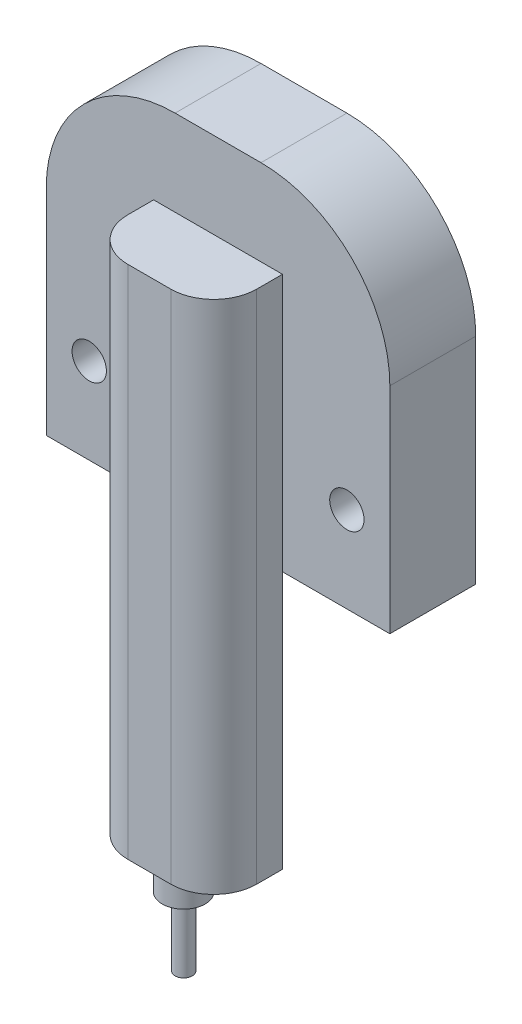
ISO-10303-21;
HEADER;
FILE_DESCRIPTION(('STEP AP214'),'2;1');
FILE_NAME('part.step','',(''),(''),'','','');
FILE_SCHEMA(('AUTOMOTIVE_DESIGN { 1 0 10303 214 1 1 1 1 }'));
ENDSEC;
DATA;
#1=APPLICATION_CONTEXT('core data for automotive mechanical design processes');
#2=APPLICATION_PROTOCOL_DEFINITION('international standard','automotive_design',2000,#1);
#3=PRODUCT_CONTEXT('',#1,'mechanical');
#4=PRODUCT('Part','Part','',(#3));
#5=PRODUCT_RELATED_PRODUCT_CATEGORY('part','',(#4));
#6=PRODUCT_DEFINITION_FORMATION('','',#4);
#7=PRODUCT_DEFINITION_CONTEXT('part definition',#1,'design');
#8=PRODUCT_DEFINITION('design','',#6,#7);
#9=PRODUCT_DEFINITION_SHAPE('','',#8);
#10=(LENGTH_UNIT() NAMED_UNIT(*) SI_UNIT(.MILLI.,.METRE.));
#11=(NAMED_UNIT(*) PLANE_ANGLE_UNIT() SI_UNIT($,.RADIAN.));
#12=(NAMED_UNIT(*) SI_UNIT($,.STERADIAN.) SOLID_ANGLE_UNIT());
#13=UNCERTAINTY_MEASURE_WITH_UNIT(LENGTH_MEASURE(1.E-05),#10,'distance_accuracy_value','');
#14=(GEOMETRIC_REPRESENTATION_CONTEXT(3) GLOBAL_UNCERTAINTY_ASSIGNED_CONTEXT((#13)) GLOBAL_UNIT_ASSIGNED_CONTEXT((#10,
#11,#12)) REPRESENTATION_CONTEXT('',''));
#15=CARTESIAN_POINT('',(0.,0.,0.));
#16=DIRECTION('',(0.,0.,1.));
#17=DIRECTION('',(1.,0.,0.));
#18=AXIS2_PLACEMENT_3D('',#15,#16,#17);
#19=CARTESIAN_POINT('',(0.,-34.,9.));
#20=DIRECTION('',(0.,-1.,0.));
#21=DIRECTION('',(0.,0.,-1.));
#22=AXIS2_PLACEMENT_3D('',#19,#20,#21);
#23=PLANE('',#22);
#24=CARTESIAN_POINT('',(0.,-34.,9.));
#25=DIRECTION('',(0.,-1.,0.));
#26=DIRECTION('',(0.,0.,-1.));
#27=AXIS2_PLACEMENT_3D('',#24,#25,#26);
#28=CIRCLE('',#27,2.5);
#29=CARTESIAN_POINT('',(0.,-34.,6.5));
#30=VERTEX_POINT('',#29);
#31=EDGE_CURVE('E152',#30,#30,#28,.T.);
#32=ORIENTED_EDGE('',*,*,#31,.T.);
#33=EDGE_LOOP('',(#32));
#34=FACE_BOUND('',#33,.T.);
#35=CARTESIAN_POINT('',(0.,-34.,9.));
#36=DIRECTION('',(0.,-1.,0.));
#37=DIRECTION('',(0.,0.,-1.));
#38=AXIS2_PLACEMENT_3D('',#35,#36,#37);
#39=CIRCLE('',#38,1.);
#40=CARTESIAN_POINT('',(0.,-34.,8.));
#41=VERTEX_POINT('',#40);
#42=EDGE_CURVE('E371',#41,#41,#39,.T.);
#43=ORIENTED_EDGE('',*,*,#42,.F.);
#44=EDGE_LOOP('',(#43));
#45=FACE_BOUND('',#44,.T.);
#46=ADVANCED_FACE('F33',(#34,#45),#23,.T.);
#47=CARTESIAN_POINT('',(-7.5,-30.,13.));
#48=DIRECTION('',(0.,1.,0.));
#49=DIRECTION('',(0.,0.,1.));
#50=AXIS2_PLACEMENT_3D('',#47,#48,#49);
#51=PLANE('',#50);
#52=DIRECTION('',(1.,0.,0.));
#53=VECTOR('',#52,1.);
#54=CARTESIAN_POINT('',(-7.5,-30.,13.));
#55=LINE('',#54,#53);
#56=CARTESIAN_POINT('',(-2.5,-30.,13.));
#57=VERTEX_POINT('',#56);
#58=CARTESIAN_POINT('',(2.5,-30.,13.));
#59=VERTEX_POINT('',#58);
#60=EDGE_CURVE('E162',#57,#59,#55,.T.);
#61=ORIENTED_EDGE('',*,*,#60,.F.);
#62=CARTESIAN_POINT('',(-2.5,-30.,8.));
#63=DIRECTION('',(0.,1.,0.));
#64=DIRECTION('',(0.,0.,1.));
#65=AXIS2_PLACEMENT_3D('',#62,#63,#64);
#66=CIRCLE('',#65,5.);
#67=CARTESIAN_POINT('',(-7.5,-30.,8.));
#68=VERTEX_POINT('',#67);
#69=EDGE_CURVE('E233',#57,#68,#66,.F.);
#70=ORIENTED_EDGE('',*,*,#69,.T.);
#71=DIRECTION('',(0.,0.,-1.));
#72=VECTOR('',#71,1.);
#73=CARTESIAN_POINT('',(-7.5,-30.,13.));
#74=LINE('',#73,#72);
#75=CARTESIAN_POINT('',(-7.5,-30.,5.));
#76=VERTEX_POINT('',#75);
#77=EDGE_CURVE('E134',#68,#76,#74,.T.);
#78=ORIENTED_EDGE('',*,*,#77,.T.);
#79=DIRECTION('',(1.,0.,0.));
#80=VECTOR('',#79,1.);
#81=CARTESIAN_POINT('',(-7.5,-30.,5.));
#82=LINE('',#81,#80);
#83=CARTESIAN_POINT('',(7.5,-30.,5.));
#84=VERTEX_POINT('',#83);
#85=EDGE_CURVE('E145',#76,#84,#82,.T.);
#86=ORIENTED_EDGE('',*,*,#85,.T.);
#87=DIRECTION('',(0.,0.,-1.));
#88=VECTOR('',#87,1.);
#89=CARTESIAN_POINT('',(7.5,-30.,13.));
#90=LINE('',#89,#88);
#91=CARTESIAN_POINT('',(7.5,-30.,8.));
#92=VERTEX_POINT('',#91);
#93=EDGE_CURVE('E160',#92,#84,#90,.T.);
#94=ORIENTED_EDGE('',*,*,#93,.F.);
#95=CARTESIAN_POINT('',(2.5,-30.,8.));
#96=DIRECTION('',(0.,1.,0.));
#97=DIRECTION('',(0.,0.,1.));
#98=AXIS2_PLACEMENT_3D('',#95,#96,#97);
#99=CIRCLE('',#98,5.);
#100=EDGE_CURVE('E231',#92,#59,#99,.F.);
#101=ORIENTED_EDGE('',*,*,#100,.T.);
#102=EDGE_LOOP('',(#61,#70,#78,#86,#94,#101));
#103=FACE_BOUND('',#102,.T.);
#104=CARTESIAN_POINT('',(0.,-30.,9.));
#105=DIRECTION('',(0.,1.,0.));
#106=DIRECTION('',(0.,0.,1.));
#107=AXIS2_PLACEMENT_3D('',#104,#105,#106);
#108=CIRCLE('',#107,2.5);
#109=CARTESIAN_POINT('',(0.,-30.,11.5));
#110=VERTEX_POINT('',#109);
#111=EDGE_CURVE('E222',#110,#110,#108,.F.);
#112=ORIENTED_EDGE('',*,*,#111,.F.);
#113=EDGE_LOOP('',(#112));
#114=FACE_BOUND('',#113,.T.);
#115=ADVANCED_FACE('F247',(#103,#114),#51,.F.);
#116=CARTESIAN_POINT('',(-20.,40.,5.));
#117=DIRECTION('',(0.,0.,-1.));
#118=DIRECTION('',(-1.,0.,0.));
#119=AXIS2_PLACEMENT_3D('',#116,#117,#118);
#120=PLANE('',#119);
#121=CARTESIAN_POINT('',(15.,10.,5.));
#122=DIRECTION('',(0.,0.,1.));
#123=DIRECTION('',(1.,0.,0.));
#124=AXIS2_PLACEMENT_3D('',#121,#122,#123);
#125=CIRCLE('',#124,2.);
#126=CARTESIAN_POINT('',(17.,10.,5.));
#127=VERTEX_POINT('',#126);
#128=EDGE_CURVE('E169',#127,#127,#125,.T.);
#129=ORIENTED_EDGE('',*,*,#128,.F.);
#130=EDGE_LOOP('',(#129));
#131=FACE_BOUND('',#130,.T.);
#132=CARTESIAN_POINT('',(-15.,10.,5.));
#133=DIRECTION('',(0.,0.,1.));
#134=DIRECTION('',(1.,0.,0.));
#135=AXIS2_PLACEMENT_3D('',#132,#133,#134);
#136=CIRCLE('',#135,2.);
#137=CARTESIAN_POINT('',(-13.,10.,5.));
#138=VERTEX_POINT('',#137);
#139=EDGE_CURVE('E165',#138,#138,#136,.T.);
#140=ORIENTED_EDGE('',*,*,#139,.F.);
#141=EDGE_LOOP('',(#140));
#142=FACE_BOUND('',#141,.T.);
#143=DIRECTION('',(0.,1.,0.));
#144=VECTOR('',#143,1.);
#145=CARTESIAN_POINT('',(7.5,-30.,5.));
#146=LINE('',#145,#144);
#147=CARTESIAN_POINT('',(7.5,0.,5.));
#148=VERTEX_POINT('',#147);
#149=CARTESIAN_POINT('',(7.5,30.,5.));
#150=VERTEX_POINT('',#149);
#151=EDGE_CURVE('E154',#148,#150,#146,.T.);
#152=ORIENTED_EDGE('',*,*,#151,.F.);
#153=DIRECTION('',(1.,0.,0.));
#154=VECTOR('',#153,1.);
#155=CARTESIAN_POINT('',(-20.,0.,5.));
#156=LINE('',#155,#154);
#157=CARTESIAN_POINT('',(20.,0.,5.));
#158=VERTEX_POINT('',#157);
#159=EDGE_CURVE('E193',#148,#158,#156,.T.);
#160=ORIENTED_EDGE('',*,*,#159,.T.);
#161=DIRECTION('',(0.,-1.,0.));
#162=VECTOR('',#161,1.);
#163=CARTESIAN_POINT('',(20.,40.,5.));
#164=LINE('',#163,#162);
#165=CARTESIAN_POINT('',(20.,25.,5.));
#166=VERTEX_POINT('',#165);
#167=EDGE_CURVE('E184',#166,#158,#164,.T.);
#168=ORIENTED_EDGE('',*,*,#167,.F.);
#169=CARTESIAN_POINT('',(5.,25.,5.));
#170=DIRECTION('',(0.,0.,-1.));
#171=DIRECTION('',(-1.,0.,0.));
#172=AXIS2_PLACEMENT_3D('',#169,#170,#171);
#173=CIRCLE('',#172,15.);
#174=CARTESIAN_POINT('',(5.,40.,5.));
#175=VERTEX_POINT('',#174);
#176=EDGE_CURVE('E210',#166,#175,#173,.F.);
#177=ORIENTED_EDGE('',*,*,#176,.T.);
#178=DIRECTION('',(1.,0.,0.));
#179=VECTOR('',#178,1.);
#180=CARTESIAN_POINT('',(-20.,40.,5.));
#181=LINE('',#180,#179);
#182=CARTESIAN_POINT('',(-5.,40.,5.));
#183=VERTEX_POINT('',#182);
#184=EDGE_CURVE('E181',#183,#175,#181,.T.);
#185=ORIENTED_EDGE('',*,*,#184,.F.);
#186=CARTESIAN_POINT('',(-5.,25.,5.));
#187=DIRECTION('',(0.,0.,-1.));
#188=DIRECTION('',(-1.,0.,0.));
#189=AXIS2_PLACEMENT_3D('',#186,#187,#188);
#190=CIRCLE('',#189,15.);
#191=CARTESIAN_POINT('',(-20.,25.,5.));
#192=VERTEX_POINT('',#191);
#193=EDGE_CURVE('E212',#183,#192,#190,.F.);
#194=ORIENTED_EDGE('',*,*,#193,.T.);
#195=DIRECTION('',(0.,-1.,0.));
#196=VECTOR('',#195,1.);
#197=CARTESIAN_POINT('',(-20.,40.,5.));
#198=LINE('',#197,#196);
#199=CARTESIAN_POINT('',(-20.,0.,5.));
#200=VERTEX_POINT('',#199);
#201=EDGE_CURVE('E198',#192,#200,#198,.T.);
#202=ORIENTED_EDGE('',*,*,#201,.T.);
#203=CARTESIAN_POINT('',(-7.5,0.,5.));
#204=VERTEX_POINT('',#203);
#205=EDGE_CURVE('E143',#200,#204,#156,.T.);
#206=ORIENTED_EDGE('',*,*,#205,.T.);
#207=DIRECTION('',(0.,-1.,0.));
#208=VECTOR('',#207,1.);
#209=CARTESIAN_POINT('',(-7.5,-30.,5.));
#210=LINE('',#209,#208);
#211=CARTESIAN_POINT('',(-7.5,30.,5.));
#212=VERTEX_POINT('',#211);
#213=EDGE_CURVE('E130',#212,#204,#210,.T.);
#214=ORIENTED_EDGE('',*,*,#213,.F.);
#215=DIRECTION('',(-1.,0.,0.));
#216=VECTOR('',#215,1.);
#217=CARTESIAN_POINT('',(-7.5,30.,5.));
#218=LINE('',#217,#216);
#219=EDGE_CURVE('E140',#150,#212,#218,.T.);
#220=ORIENTED_EDGE('',*,*,#219,.F.);
#221=EDGE_LOOP('',(#152,#160,#168,#177,#185,#194,#202,#206,#214,#220));
#222=FACE_BOUND('',#221,.T.);
#223=ADVANCED_FACE('F139',(#131,#142,#222),#120,.F.);
#224=CARTESIAN_POINT('',(20.,40.,-5.));
#225=DIRECTION('',(-1.,0.,0.));
#226=DIRECTION('',(0.,0.,1.));
#227=AXIS2_PLACEMENT_3D('',#224,#225,#226);
#228=PLANE('',#227);
#229=DIRECTION('',(0.,-1.,0.));
#230=VECTOR('',#229,1.);
#231=CARTESIAN_POINT('',(20.,40.,-5.));
#232=LINE('',#231,#230);
#233=CARTESIAN_POINT('',(20.,25.,-5.));
#234=VERTEX_POINT('',#233);
#235=CARTESIAN_POINT('',(20.,0.,-5.));
#236=VERTEX_POINT('',#235);
#237=EDGE_CURVE('E202',#234,#236,#232,.T.);
#238=ORIENTED_EDGE('',*,*,#237,.F.);
#239=DIRECTION('',(0.,0.,-1.));
#240=VECTOR('',#239,1.);
#241=CARTESIAN_POINT('',(20.,25.,5.));
#242=LINE('',#241,#240);
#243=EDGE_CURVE('E220',#234,#166,#242,.F.);
#244=ORIENTED_EDGE('',*,*,#243,.T.);
#245=ORIENTED_EDGE('',*,*,#167,.T.);
#246=DIRECTION('',(0.,0.,-1.));
#247=VECTOR('',#246,1.);
#248=CARTESIAN_POINT('',(20.,0.,-5.));
#249=LINE('',#248,#247);
#250=EDGE_CURVE('E175',#158,#236,#249,.T.);
#251=ORIENTED_EDGE('',*,*,#250,.T.);
#252=EDGE_LOOP('',(#238,#244,#245,#251));
#253=FACE_BOUND('',#252,.T.);
#254=ADVANCED_FACE('F269',(#253),#228,.F.);
#255=CARTESIAN_POINT('',(-20.,40.,-5.));
#256=DIRECTION('',(0.,0.,1.));
#257=DIRECTION('',(1.,0.,0.));
#258=AXIS2_PLACEMENT_3D('',#255,#256,#257);
#259=PLANE('',#258);
#260=CARTESIAN_POINT('',(-15.,10.,-5.));
#261=DIRECTION('',(0.,0.,1.));
#262=DIRECTION('',(1.,0.,0.));
#263=AXIS2_PLACEMENT_3D('',#260,#261,#262);
#264=CIRCLE('',#263,2.);
#265=CARTESIAN_POINT('',(-13.,10.,-5.));
#266=VERTEX_POINT('',#265);
#267=EDGE_CURVE('E166',#266,#266,#264,.T.);
#268=ORIENTED_EDGE('',*,*,#267,.T.);
#269=EDGE_LOOP('',(#268));
#270=FACE_BOUND('',#269,.T.);
#271=CARTESIAN_POINT('',(15.,10.,-5.));
#272=DIRECTION('',(0.,0.,1.));
#273=DIRECTION('',(1.,0.,0.));
#274=AXIS2_PLACEMENT_3D('',#271,#272,#273);
#275=CIRCLE('',#274,2.);
#276=CARTESIAN_POINT('',(17.,10.,-5.));
#277=VERTEX_POINT('',#276);
#278=EDGE_CURVE('E172',#277,#277,#275,.T.);
#279=ORIENTED_EDGE('',*,*,#278,.T.);
#280=EDGE_LOOP('',(#279));
#281=FACE_BOUND('',#280,.T.);
#282=DIRECTION('',(0.,-1.,0.));
#283=VECTOR('',#282,1.);
#284=CARTESIAN_POINT('',(-20.,40.,-5.));
#285=LINE('',#284,#283);
#286=CARTESIAN_POINT('',(-20.,25.,-5.));
#287=VERTEX_POINT('',#286);
#288=CARTESIAN_POINT('',(-20.,0.,-5.));
#289=VERTEX_POINT('',#288);
#290=EDGE_CURVE('E200',#287,#289,#285,.T.);
#291=ORIENTED_EDGE('',*,*,#290,.F.);
#292=CARTESIAN_POINT('',(-5.,25.,-5.));
#293=DIRECTION('',(0.,0.,1.));
#294=DIRECTION('',(1.,0.,0.));
#295=AXIS2_PLACEMENT_3D('',#292,#293,#294);
#296=CIRCLE('',#295,15.);
#297=CARTESIAN_POINT('',(-5.,40.,-5.));
#298=VERTEX_POINT('',#297);
#299=EDGE_CURVE('E218',#287,#298,#296,.F.);
#300=ORIENTED_EDGE('',*,*,#299,.T.);
#301=DIRECTION('',(-1.,0.,0.));
#302=VECTOR('',#301,1.);
#303=CARTESIAN_POINT('',(-20.,40.,-5.));
#304=LINE('',#303,#302);
#305=CARTESIAN_POINT('',(5.,40.,-5.));
#306=VERTEX_POINT('',#305);
#307=EDGE_CURVE('E178',#306,#298,#304,.T.);
#308=ORIENTED_EDGE('',*,*,#307,.F.);
#309=CARTESIAN_POINT('',(5.,25.,-5.));
#310=DIRECTION('',(0.,0.,1.));
#311=DIRECTION('',(1.,0.,0.));
#312=AXIS2_PLACEMENT_3D('',#309,#310,#311);
#313=CIRCLE('',#312,15.);
#314=EDGE_CURVE('E216',#306,#234,#313,.F.);
#315=ORIENTED_EDGE('',*,*,#314,.T.);
#316=ORIENTED_EDGE('',*,*,#237,.T.);
#317=DIRECTION('',(-1.,0.,0.));
#318=VECTOR('',#317,1.);
#319=CARTESIAN_POINT('',(-20.,0.,-5.));
#320=LINE('',#319,#318);
#321=EDGE_CURVE('E187',#236,#289,#320,.T.);
#322=ORIENTED_EDGE('',*,*,#321,.T.);
#323=EDGE_LOOP('',(#291,#300,#308,#315,#316,#322));
#324=FACE_BOUND('',#323,.T.);
#325=ADVANCED_FACE('F282',(#270,#281,#324),#259,.F.);
#326=CARTESIAN_POINT('',(-20.,40.,-5.));
#327=DIRECTION('',(1.,0.,0.));
#328=DIRECTION('',(0.,0.,-1.));
#329=AXIS2_PLACEMENT_3D('',#326,#327,#328);
#330=PLANE('',#329);
#331=ORIENTED_EDGE('',*,*,#201,.F.);
#332=DIRECTION('',(0.,0.,1.));
#333=VECTOR('',#332,1.);
#334=CARTESIAN_POINT('',(-20.,25.,-5.));
#335=LINE('',#334,#333);
#336=EDGE_CURVE('E214',#192,#287,#335,.F.);
#337=ORIENTED_EDGE('',*,*,#336,.T.);
#338=ORIENTED_EDGE('',*,*,#290,.T.);
#339=DIRECTION('',(0.,0.,1.));
#340=VECTOR('',#339,1.);
#341=CARTESIAN_POINT('',(-20.,0.,-5.));
#342=LINE('',#341,#340);
#343=EDGE_CURVE('E190',#289,#200,#342,.T.);
#344=ORIENTED_EDGE('',*,*,#343,.T.);
#345=EDGE_LOOP('',(#331,#337,#338,#344));
#346=FACE_BOUND('',#345,.T.);
#347=ADVANCED_FACE('F289',(#346),#330,.F.);
#348=CARTESIAN_POINT('',(0.,40.,0.));
#349=DIRECTION('',(0.,1.,0.));
#350=DIRECTION('',(0.,0.,1.));
#351=AXIS2_PLACEMENT_3D('',#348,#349,#350);
#352=PLANE('',#351);
#353=ORIENTED_EDGE('',*,*,#307,.T.);
#354=DIRECTION('',(0.,0.,1.));
#355=VECTOR('',#354,1.);
#356=CARTESIAN_POINT('',(-5.,40.,5.));
#357=LINE('',#356,#355);
#358=EDGE_CURVE('E207',#298,#183,#357,.T.);
#359=ORIENTED_EDGE('',*,*,#358,.T.);
#360=ORIENTED_EDGE('',*,*,#184,.T.);
#361=DIRECTION('',(0.,0.,-1.));
#362=VECTOR('',#361,1.);
#363=CARTESIAN_POINT('',(5.,40.,-5.));
#364=LINE('',#363,#362);
#365=EDGE_CURVE('E204',#175,#306,#364,.T.);
#366=ORIENTED_EDGE('',*,*,#365,.T.);
#367=EDGE_LOOP('',(#353,#359,#360,#366));
#368=FACE_BOUND('',#367,.T.);
#369=ADVANCED_FACE('F278',(#368),#352,.T.);
#370=CARTESIAN_POINT('',(0.,0.,0.));
#371=DIRECTION('',(0.,1.,0.));
#372=DIRECTION('',(0.,0.,1.));
#373=AXIS2_PLACEMENT_3D('',#370,#371,#372);
#374=PLANE('',#373);
#375=ORIENTED_EDGE('',*,*,#250,.F.);
#376=ORIENTED_EDGE('',*,*,#159,.F.);
#377=EDGE_CURVE('E195',#204,#148,#156,.T.);
#378=ORIENTED_EDGE('',*,*,#377,.F.);
#379=ORIENTED_EDGE('',*,*,#205,.F.);
#380=ORIENTED_EDGE('',*,*,#343,.F.);
#381=ORIENTED_EDGE('',*,*,#321,.F.);
#382=EDGE_LOOP('',(#375,#376,#378,#379,#380,#381));
#383=FACE_BOUND('',#382,.T.);
#384=ADVANCED_FACE('F264',(#383),#374,.F.);
#385=CARTESIAN_POINT('',(-5.,25.,0.));
#386=DIRECTION('',(0.,0.,-1.));
#387=DIRECTION('',(-1.,0.,0.));
#388=AXIS2_PLACEMENT_3D('',#385,#386,#387);
#389=CYLINDRICAL_SURFACE('',#388,15.);
#390=ORIENTED_EDGE('',*,*,#299,.F.);
#391=ORIENTED_EDGE('',*,*,#336,.F.);
#392=ORIENTED_EDGE('',*,*,#193,.F.);
#393=ORIENTED_EDGE('',*,*,#358,.F.);
#394=EDGE_LOOP('',(#390,#391,#392,#393));
#395=FACE_BOUND('',#394,.T.);
#396=ADVANCED_FACE('F286',(#395),#389,.T.);
#397=CARTESIAN_POINT('',(5.,25.,0.));
#398=DIRECTION('',(0.,0.,1.));
#399=DIRECTION('',(1.,0.,0.));
#400=AXIS2_PLACEMENT_3D('',#397,#398,#399);
#401=CYLINDRICAL_SURFACE('',#400,15.);
#402=ORIENTED_EDGE('',*,*,#176,.F.);
#403=ORIENTED_EDGE('',*,*,#243,.F.);
#404=ORIENTED_EDGE('',*,*,#314,.F.);
#405=ORIENTED_EDGE('',*,*,#365,.F.);
#406=EDGE_LOOP('',(#402,#403,#404,#405));
#407=FACE_BOUND('',#406,.T.);
#408=ADVANCED_FACE('F275',(#407),#401,.T.);
#409=CARTESIAN_POINT('',(15.,10.,-5.));
#410=DIRECTION('',(0.,0.,1.));
#411=DIRECTION('',(1.,0.,0.));
#412=AXIS2_PLACEMENT_3D('',#409,#410,#411);
#413=CYLINDRICAL_SURFACE('',#412,2.);
#414=ORIENTED_EDGE('',*,*,#278,.F.);
#415=EDGE_LOOP('',(#414));
#416=FACE_BOUND('',#415,.T.);
#417=ORIENTED_EDGE('',*,*,#128,.T.);
#418=EDGE_LOOP('',(#417));
#419=FACE_BOUND('',#418,.T.);
#420=ADVANCED_FACE('F333',(#416,#419),#413,.F.);
#421=CARTESIAN_POINT('',(-15.,10.,-5.));
#422=DIRECTION('',(0.,0.,1.));
#423=DIRECTION('',(1.,0.,0.));
#424=AXIS2_PLACEMENT_3D('',#421,#422,#423);
#425=CYLINDRICAL_SURFACE('',#424,2.);
#426=ORIENTED_EDGE('',*,*,#267,.F.);
#427=EDGE_LOOP('',(#426));
#428=FACE_BOUND('',#427,.T.);
#429=ORIENTED_EDGE('',*,*,#139,.T.);
#430=EDGE_LOOP('',(#429));
#431=FACE_BOUND('',#430,.T.);
#432=ADVANCED_FACE('F330',(#428,#431),#425,.F.);
#433=CARTESIAN_POINT('',(7.5,-30.,13.));
#434=DIRECTION('',(-1.,0.,0.));
#435=DIRECTION('',(0.,0.,1.));
#436=AXIS2_PLACEMENT_3D('',#433,#434,#435);
#437=PLANE('',#436);
#438=DIRECTION('',(0.,0.,-1.));
#439=VECTOR('',#438,1.);
#440=CARTESIAN_POINT('',(7.5,30.,13.));
#441=LINE('',#440,#439);
#442=CARTESIAN_POINT('',(7.5,30.,8.));
#443=VERTEX_POINT('',#442);
#444=EDGE_CURVE('E133',#443,#150,#441,.T.);
#445=ORIENTED_EDGE('',*,*,#444,.F.);
#446=DIRECTION('',(0.,1.,0.));
#447=VECTOR('',#446,1.);
#448=CARTESIAN_POINT('',(7.5,-30.,8.));
#449=LINE('',#448,#447);
#450=EDGE_CURVE('E11',#443,#92,#449,.F.);
#451=ORIENTED_EDGE('',*,*,#450,.T.);
#452=ORIENTED_EDGE('',*,*,#93,.T.);
#453=EDGE_CURVE('E149',#84,#148,#146,.T.);
#454=ORIENTED_EDGE('',*,*,#453,.T.);
#455=ORIENTED_EDGE('',*,*,#151,.T.);
#456=EDGE_LOOP('',(#445,#451,#452,#454,#455));
#457=FACE_BOUND('',#456,.T.);
#458=ADVANCED_FACE('F259',(#457),#437,.F.);
#459=CARTESIAN_POINT('',(-7.5,30.,13.));
#460=DIRECTION('',(0.,-1.,0.));
#461=DIRECTION('',(0.,0.,-1.));
#462=AXIS2_PLACEMENT_3D('',#459,#460,#461);
#463=PLANE('',#462);
#464=DIRECTION('',(0.,0.,-1.));
#465=VECTOR('',#464,1.);
#466=CARTESIAN_POINT('',(-7.5,30.,13.));
#467=LINE('',#466,#465);
#468=CARTESIAN_POINT('',(-7.5,30.,8.));
#469=VERTEX_POINT('',#468);
#470=EDGE_CURVE('E126',#469,#212,#467,.T.);
#471=ORIENTED_EDGE('',*,*,#470,.F.);
#472=CARTESIAN_POINT('',(-2.5,30.,8.));
#473=DIRECTION('',(0.,-1.,0.));
#474=DIRECTION('',(0.,0.,-1.));
#475=AXIS2_PLACEMENT_3D('',#472,#473,#474);
#476=CIRCLE('',#475,5.);
#477=CARTESIAN_POINT('',(-2.5,30.,13.));
#478=VERTEX_POINT('',#477);
#479=EDGE_CURVE('E41',#469,#478,#476,.F.);
#480=ORIENTED_EDGE('',*,*,#479,.T.);
#481=DIRECTION('',(-1.,0.,0.));
#482=VECTOR('',#481,1.);
#483=CARTESIAN_POINT('',(-7.5,30.,13.));
#484=LINE('',#483,#482);
#485=CARTESIAN_POINT('',(2.5,30.,13.));
#486=VERTEX_POINT('',#485);
#487=EDGE_CURVE('E159',#486,#478,#484,.T.);
#488=ORIENTED_EDGE('',*,*,#487,.F.);
#489=CARTESIAN_POINT('',(2.5,30.,8.));
#490=DIRECTION('',(0.,-1.,0.));
#491=DIRECTION('',(0.,0.,-1.));
#492=AXIS2_PLACEMENT_3D('',#489,#490,#491);
#493=CIRCLE('',#492,5.);
#494=EDGE_CURVE('E48',#486,#443,#493,.F.);
#495=ORIENTED_EDGE('',*,*,#494,.T.);
#496=ORIENTED_EDGE('',*,*,#444,.T.);
#497=ORIENTED_EDGE('',*,*,#219,.T.);
#498=EDGE_LOOP('',(#471,#480,#488,#495,#496,#497));
#499=FACE_BOUND('',#498,.T.);
#500=ADVANCED_FACE('F148',(#499),#463,.F.);
#501=CARTESIAN_POINT('',(-7.5,-30.,13.));
#502=DIRECTION('',(1.,0.,0.));
#503=DIRECTION('',(0.,0.,-1.));
#504=AXIS2_PLACEMENT_3D('',#501,#502,#503);
#505=PLANE('',#504);
#506=ORIENTED_EDGE('',*,*,#77,.F.);
#507=DIRECTION('',(0.,-1.,0.));
#508=VECTOR('',#507,1.);
#509=CARTESIAN_POINT('',(-7.5,-30.,8.));
#510=LINE('',#509,#508);
#511=EDGE_CURVE('E56',#68,#469,#510,.F.);
#512=ORIENTED_EDGE('',*,*,#511,.T.);
#513=ORIENTED_EDGE('',*,*,#470,.T.);
#514=ORIENTED_EDGE('',*,*,#213,.T.);
#515=EDGE_CURVE('E146',#204,#76,#210,.T.);
#516=ORIENTED_EDGE('',*,*,#515,.T.);
#517=EDGE_LOOP('',(#506,#512,#513,#514,#516));
#518=FACE_BOUND('',#517,.T.);
#519=ADVANCED_FACE('F128',(#518),#505,.F.);
#520=CARTESIAN_POINT('',(0.,0.,13.));
#521=DIRECTION('',(0.,0.,-1.));
#522=DIRECTION('',(-1.,0.,0.));
#523=AXIS2_PLACEMENT_3D('',#520,#521,#522);
#524=PLANE('',#523);
#525=ORIENTED_EDGE('',*,*,#487,.T.);
#526=DIRECTION('',(0.,-1.,0.));
#527=VECTOR('',#526,1.);
#528=CARTESIAN_POINT('',(-2.5,0.,13.));
#529=LINE('',#528,#527);
#530=EDGE_CURVE('E228',#478,#57,#529,.T.);
#531=ORIENTED_EDGE('',*,*,#530,.T.);
#532=ORIENTED_EDGE('',*,*,#60,.T.);
#533=DIRECTION('',(0.,1.,0.));
#534=VECTOR('',#533,1.);
#535=CARTESIAN_POINT('',(2.5,0.,13.));
#536=LINE('',#535,#534);
#537=EDGE_CURVE('E225',#59,#486,#536,.T.);
#538=ORIENTED_EDGE('',*,*,#537,.T.);
#539=EDGE_LOOP('',(#525,#531,#532,#538));
#540=FACE_BOUND('',#539,.T.);
#541=ADVANCED_FACE('F240',(#540),#524,.F.);
#542=CARTESIAN_POINT('',(0.,0.,5.));
#543=DIRECTION('',(0.,0.,-1.));
#544=DIRECTION('',(-1.,0.,0.));
#545=AXIS2_PLACEMENT_3D('',#542,#543,#544);
#546=PLANE('',#545);
#547=ORIENTED_EDGE('',*,*,#515,.F.);
#548=ORIENTED_EDGE('',*,*,#377,.T.);
#549=ORIENTED_EDGE('',*,*,#453,.F.);
#550=ORIENTED_EDGE('',*,*,#85,.F.);
#551=EDGE_LOOP('',(#547,#548,#549,#550));
#552=FACE_BOUND('',#551,.T.);
#553=ADVANCED_FACE('F253',(#552),#546,.T.);
#554=CARTESIAN_POINT('',(0.,-34.,9.));
#555=DIRECTION('',(0.,1.,0.));
#556=DIRECTION('',(0.,0.,1.));
#557=AXIS2_PLACEMENT_3D('',#554,#555,#556);
#558=CYLINDRICAL_SURFACE('',#557,2.5);
#559=ORIENTED_EDGE('',*,*,#31,.F.);
#560=EDGE_LOOP('',(#559));
#561=FACE_BOUND('',#560,.T.);
#562=ORIENTED_EDGE('',*,*,#111,.T.);
#563=EDGE_LOOP('',(#562));
#564=FACE_BOUND('',#563,.T.);
#565=ADVANCED_FACE('F316',(#561,#564),#558,.T.);
#566=CARTESIAN_POINT('',(0.,-42.,9.));
#567=DIRECTION('',(0.,1.,0.));
#568=DIRECTION('',(0.,0.,1.));
#569=AXIS2_PLACEMENT_3D('',#566,#567,#568);
#570=CYLINDRICAL_SURFACE('',#569,1.);
#571=CARTESIAN_POINT('',(0.,-42.,9.));
#572=DIRECTION('',(0.,-1.,0.));
#573=DIRECTION('',(0.,0.,-1.));
#574=AXIS2_PLACEMENT_3D('',#571,#572,#573);
#575=CIRCLE('',#574,1.);
#576=CARTESIAN_POINT('',(0.,-42.,8.));
#577=VERTEX_POINT('',#576);
#578=EDGE_CURVE('E370',#577,#577,#575,.T.);
#579=ORIENTED_EDGE('',*,*,#578,.F.);
#580=EDGE_LOOP('',(#579));
#581=FACE_BOUND('',#580,.T.);
#582=ORIENTED_EDGE('',*,*,#42,.T.);
#583=EDGE_LOOP('',(#582));
#584=FACE_BOUND('',#583,.T.);
#585=ADVANCED_FACE('F314',(#581,#584),#570,.T.);
#586=CARTESIAN_POINT('',(0.,-42.,9.));
#587=DIRECTION('',(0.,-1.,0.));
#588=DIRECTION('',(0.,0.,-1.));
#589=AXIS2_PLACEMENT_3D('',#586,#587,#588);
#590=PLANE('',#589);
#591=ORIENTED_EDGE('',*,*,#578,.T.);
#592=EDGE_LOOP('',(#591));
#593=FACE_BOUND('',#592,.T.);
#594=ADVANCED_FACE('F358',(#593),#590,.T.);
#595=CARTESIAN_POINT('',(-2.5,0.,8.));
#596=DIRECTION('',(0.,-1.,0.));
#597=DIRECTION('',(0.,0.,-1.));
#598=AXIS2_PLACEMENT_3D('',#595,#596,#597);
#599=CYLINDRICAL_SURFACE('',#598,5.);
#600=ORIENTED_EDGE('',*,*,#479,.F.);
#601=ORIENTED_EDGE('',*,*,#511,.F.);
#602=ORIENTED_EDGE('',*,*,#69,.F.);
#603=ORIENTED_EDGE('',*,*,#530,.F.);
#604=EDGE_LOOP('',(#600,#601,#602,#603));
#605=FACE_BOUND('',#604,.T.);
#606=ADVANCED_FACE('F245',(#605),#599,.T.);
#607=CARTESIAN_POINT('',(2.5,0.,8.));
#608=DIRECTION('',(0.,1.,0.));
#609=DIRECTION('',(0.,0.,1.));
#610=AXIS2_PLACEMENT_3D('',#607,#608,#609);
#611=CYLINDRICAL_SURFACE('',#610,5.);
#612=ORIENTED_EDGE('',*,*,#100,.F.);
#613=ORIENTED_EDGE('',*,*,#450,.F.);
#614=ORIENTED_EDGE('',*,*,#494,.F.);
#615=ORIENTED_EDGE('',*,*,#537,.F.);
#616=EDGE_LOOP('',(#612,#613,#614,#615));
#617=FACE_BOUND('',#616,.T.);
#618=ADVANCED_FACE('F35',(#617),#611,.T.);
#619=CLOSED_SHELL('',(#46,#115,#223,#254,#325,#347,#369,#384,#396,#408,#420,#432,#458,#500,#519,
#541,#553,#565,#585,#594,#606,#618));
#620=MANIFOLD_SOLID_BREP('B2',#619);
#621=ADVANCED_BREP_SHAPE_REPRESENTATION('',(#18,#620),#14);
#622=SHAPE_DEFINITION_REPRESENTATION(#9,#621);
ENDSEC;
END-ISO-10303-21;
